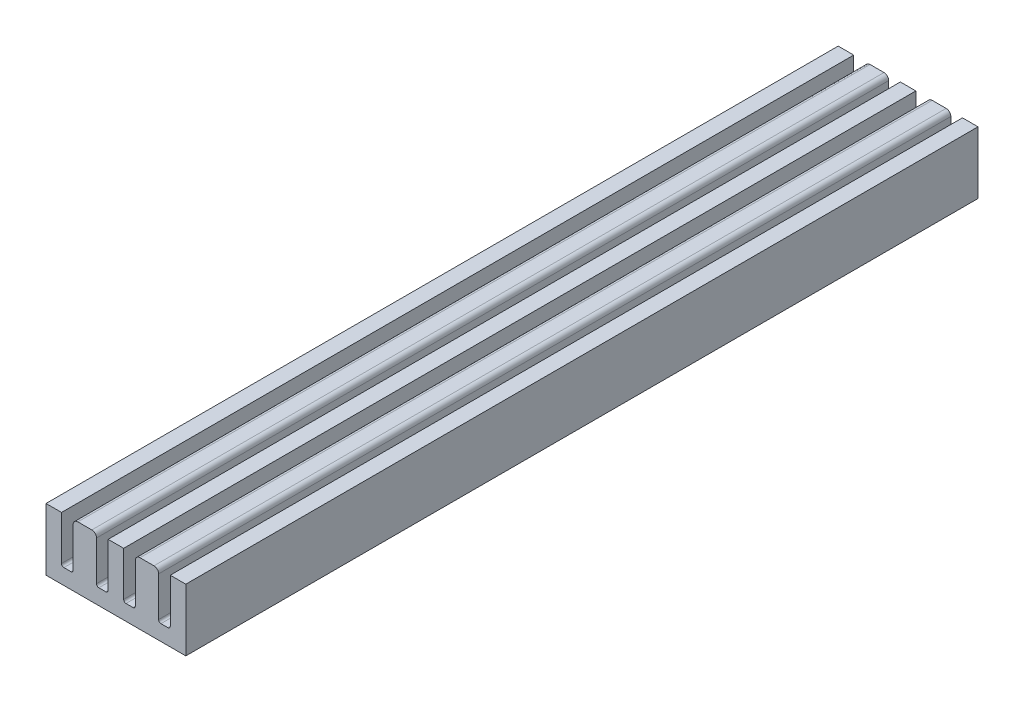
ISO-10303-21;
HEADER;
FILE_DESCRIPTION(('STEP AP214'),'2;1');
FILE_NAME('part.step','',(''),(''),'','','');
FILE_SCHEMA(('AUTOMOTIVE_DESIGN { 1 0 10303 214 1 1 1 1 }'));
ENDSEC;
DATA;
#1=APPLICATION_CONTEXT('core data for automotive mechanical design processes');
#2=APPLICATION_PROTOCOL_DEFINITION('international standard','automotive_design',2000,#1);
#3=PRODUCT_CONTEXT('',#1,'mechanical');
#4=PRODUCT('Part','Part','',(#3));
#5=PRODUCT_RELATED_PRODUCT_CATEGORY('part','',(#4));
#6=PRODUCT_DEFINITION_FORMATION('','',#4);
#7=PRODUCT_DEFINITION_CONTEXT('part definition',#1,'design');
#8=PRODUCT_DEFINITION('design','',#6,#7);
#9=PRODUCT_DEFINITION_SHAPE('','',#8);
#10=(LENGTH_UNIT() NAMED_UNIT(*) SI_UNIT(.MILLI.,.METRE.));
#11=(NAMED_UNIT(*) PLANE_ANGLE_UNIT() SI_UNIT($,.RADIAN.));
#12=(NAMED_UNIT(*) SI_UNIT($,.STERADIAN.) SOLID_ANGLE_UNIT());
#13=UNCERTAINTY_MEASURE_WITH_UNIT(LENGTH_MEASURE(1.E-05),#10,'distance_accuracy_value','');
#14=(GEOMETRIC_REPRESENTATION_CONTEXT(3) GLOBAL_UNCERTAINTY_ASSIGNED_CONTEXT((#13)) GLOBAL_UNIT_ASSIGNED_CONTEXT((#10,
#11,#12)) REPRESENTATION_CONTEXT('',''));
#15=CARTESIAN_POINT('',(0.,0.,0.));
#16=DIRECTION('',(0.,0.,1.));
#17=DIRECTION('',(1.,0.,0.));
#18=AXIS2_PLACEMENT_3D('',#15,#16,#17);
#19=CARTESIAN_POINT('',(0.,-37.8703703703704,102.));
#20=DIRECTION('',(0.,-1.,0.));
#21=DIRECTION('',(0.,0.,-1.));
#22=AXIS2_PLACEMENT_3D('',#19,#20,#21);
#23=PLANE('',#22);
#24=DIRECTION('',(0.,0.,-1.));
#25=VECTOR('',#24,1.);
#26=CARTESIAN_POINT('',(8.69813267683274,-37.8703703703704,102.));
#27=LINE('',#26,#25);
#28=CARTESIAN_POINT('',(8.69813267683274,-37.8703703703704,102.));
#29=VERTEX_POINT('',#28);
#30=CARTESIAN_POINT('',(8.69813267683274,-37.8703703703704,0.));
#31=VERTEX_POINT('',#30);
#32=EDGE_CURVE('E267',#29,#31,#27,.T.);
#33=ORIENTED_EDGE('',*,*,#32,.T.);
#34=DIRECTION('',(-1.,0.,0.));
#35=VECTOR('',#34,1.);
#36=CARTESIAN_POINT('',(0.,-37.8703703703704,0.));
#37=LINE('',#36,#35);
#38=CARTESIAN_POINT('',(7.80186732316727,-37.8703703703704,0.));
#39=VERTEX_POINT('',#38);
#40=EDGE_CURVE('E404',#31,#39,#37,.T.);
#41=ORIENTED_EDGE('',*,*,#40,.T.);
#42=DIRECTION('',(0.,0.,-1.));
#43=VECTOR('',#42,1.);
#44=CARTESIAN_POINT('',(7.80186732316727,-37.8703703703704,102.));
#45=LINE('',#44,#43);
#46=CARTESIAN_POINT('',(7.80186732316727,-37.8703703703704,102.));
#47=VERTEX_POINT('',#46);
#48=EDGE_CURVE('E321',#47,#39,#45,.T.);
#49=ORIENTED_EDGE('',*,*,#48,.F.);
#50=DIRECTION('',(-1.,0.,0.));
#51=VECTOR('',#50,1.);
#52=CARTESIAN_POINT('',(0.,-37.8703703703704,102.));
#53=LINE('',#52,#51);
#54=EDGE_CURVE('E395',#29,#47,#53,.T.);
#55=ORIENTED_EDGE('',*,*,#54,.F.);
#56=EDGE_LOOP('',(#33,#41,#49,#55));
#57=FACE_BOUND('',#56,.T.);
#58=ADVANCED_FACE('F35',(#57),#23,.F.);
#59=DIRECTION('',(0.,0.,-1.));
#60=VECTOR('',#59,1.);
#61=CARTESIAN_POINT('',(4.19813267683273,-37.8703703703704,102.));
#62=LINE('',#61,#60);
#63=CARTESIAN_POINT('',(4.19813267683273,-37.8703703703704,102.));
#64=VERTEX_POINT('',#63);
#65=CARTESIAN_POINT('',(4.19813267683273,-37.8703703703704,0.));
#66=VERTEX_POINT('',#65);
#67=EDGE_CURVE('E324',#64,#66,#62,.T.);
#68=ORIENTED_EDGE('',*,*,#67,.T.);
#69=CARTESIAN_POINT('',(3.30186732316727,-37.8703703703704,0.));
#70=VERTEX_POINT('',#69);
#71=EDGE_CURVE('E407',#66,#70,#37,.T.);
#72=ORIENTED_EDGE('',*,*,#71,.T.);
#73=DIRECTION('',(0.,0.,-1.));
#74=VECTOR('',#73,1.);
#75=CARTESIAN_POINT('',(3.30186732316727,-37.8703703703704,102.));
#76=LINE('',#75,#74);
#77=CARTESIAN_POINT('',(3.30186732316727,-37.8703703703704,102.));
#78=VERTEX_POINT('',#77);
#79=EDGE_CURVE('E364',#78,#70,#76,.T.);
#80=ORIENTED_EDGE('',*,*,#79,.F.);
#81=EDGE_CURVE('E398',#64,#78,#53,.T.);
#82=ORIENTED_EDGE('',*,*,#81,.F.);
#83=EDGE_LOOP('',(#68,#72,#80,#82));
#84=FACE_BOUND('',#83,.T.);
#85=ADVANCED_FACE('F512',(#84),#23,.F.);
#86=DIRECTION('',(0.,0.,-1.));
#87=VECTOR('',#86,1.);
#88=CARTESIAN_POINT('',(0.698132676832736,-37.8703703703704,102.));
#89=LINE('',#88,#87);
#90=CARTESIAN_POINT('',(0.698132676832736,-37.8703703703704,102.));
#91=VERTEX_POINT('',#90);
#92=CARTESIAN_POINT('',(0.698132676832736,-37.8703703703704,0.));
#93=VERTEX_POINT('',#92);
#94=EDGE_CURVE('E367',#91,#93,#89,.T.);
#95=ORIENTED_EDGE('',*,*,#94,.T.);
#96=CARTESIAN_POINT('',(-0.198132676832732,-37.8703703703704,0.));
#97=VERTEX_POINT('',#96);
#98=EDGE_CURVE('E566',#93,#97,#37,.T.);
#99=ORIENTED_EDGE('',*,*,#98,.T.);
#100=DIRECTION('',(0.,0.,-1.));
#101=VECTOR('',#100,1.);
#102=CARTESIAN_POINT('',(-0.198132676832732,-37.8703703703704,102.));
#103=LINE('',#102,#101);
#104=CARTESIAN_POINT('',(-0.198132676832732,-37.8703703703704,102.));
#105=VERTEX_POINT('',#104);
#106=EDGE_CURVE('E424',#105,#97,#103,.T.);
#107=ORIENTED_EDGE('',*,*,#106,.F.);
#108=EDGE_CURVE('E539',#91,#105,#53,.T.);
#109=ORIENTED_EDGE('',*,*,#108,.F.);
#110=EDGE_LOOP('',(#95,#99,#107,#109));
#111=FACE_BOUND('',#110,.T.);
#112=ADVANCED_FACE('F519',(#111),#23,.F.);
#113=DIRECTION('',(0.,0.,-1.));
#114=VECTOR('',#113,1.);
#115=CARTESIAN_POINT('',(-4.69813267683273,-37.8703703703704,102.));
#116=LINE('',#115,#114);
#117=CARTESIAN_POINT('',(-4.69813267683273,-37.8703703703704,102.));
#118=VERTEX_POINT('',#117);
#119=CARTESIAN_POINT('',(-4.69813267683273,-37.8703703703704,0.));
#120=VERTEX_POINT('',#119);
#121=EDGE_CURVE('E393',#118,#120,#116,.T.);
#122=ORIENTED_EDGE('',*,*,#121,.F.);
#123=CARTESIAN_POINT('',(-3.80186732316727,-37.8703703703704,102.));
#124=VERTEX_POINT('',#123);
#125=EDGE_CURVE('E256',#124,#118,#53,.T.);
#126=ORIENTED_EDGE('',*,*,#125,.F.);
#127=DIRECTION('',(0.,0.,-1.));
#128=VECTOR('',#127,1.);
#129=CARTESIAN_POINT('',(-3.80186732316727,-37.8703703703704,102.));
#130=LINE('',#129,#128);
#131=CARTESIAN_POINT('',(-3.80186732316727,-37.8703703703704,0.));
#132=VERTEX_POINT('',#131);
#133=EDGE_CURVE('E436',#124,#132,#130,.T.);
#134=ORIENTED_EDGE('',*,*,#133,.T.);
#135=EDGE_CURVE('E403',#132,#120,#37,.T.);
#136=ORIENTED_EDGE('',*,*,#135,.T.);
#137=EDGE_LOOP('',(#122,#126,#134,#136));
#138=FACE_BOUND('',#137,.T.);
#139=ADVANCED_FACE('F515',(#138),#23,.F.);
#140=CARTESIAN_POINT('',(-0.499999999999999,0.,102.));
#141=DIRECTION('',(1.,0.,0.));
#142=DIRECTION('',(0.,0.,-1.));
#143=AXIS2_PLACEMENT_3D('',#140,#141,#142);
#144=PLANE('',#143);
#145=DIRECTION('',(0.,-1.,0.));
#146=VECTOR('',#145,1.);
#147=CARTESIAN_POINT('',(-0.499999999999999,0.,0.));
#148=LINE('',#147,#146);
#149=CARTESIAN_POINT('',(-0.499999999999999,-32.4703703703704,0.));
#150=VERTEX_POINT('',#149);
#151=CARTESIAN_POINT('',(-0.499999999999999,-37.5685030472031,0.));
#152=VERTEX_POINT('',#151);
#153=EDGE_CURVE('E443',#150,#152,#148,.T.);
#154=ORIENTED_EDGE('',*,*,#153,.F.);
#155=DIRECTION('',(0.,0.,-1.));
#156=VECTOR('',#155,1.);
#157=CARTESIAN_POINT('',(-0.499999999999999,-32.4703703703704,102.));
#158=LINE('',#157,#156);
#159=CARTESIAN_POINT('',(-0.499999999999999,-32.4703703703704,102.));
#160=VERTEX_POINT('',#159);
#161=EDGE_CURVE('E43',#150,#160,#158,.F.);
#162=ORIENTED_EDGE('',*,*,#161,.T.);
#163=DIRECTION('',(0.,-1.,0.));
#164=VECTOR('',#163,1.);
#165=CARTESIAN_POINT('',(-0.499999999999999,0.,102.));
#166=LINE('',#165,#164);
#167=CARTESIAN_POINT('',(-0.499999999999999,-37.5685030472031,102.));
#168=VERTEX_POINT('',#167);
#169=EDGE_CURVE('E445',#160,#168,#166,.T.);
#170=ORIENTED_EDGE('',*,*,#169,.T.);
#171=DIRECTION('',(0.,0.,-1.));
#172=VECTOR('',#171,1.);
#173=CARTESIAN_POINT('',(-0.499999999999999,-37.5685030472031,102.));
#174=LINE('',#173,#172);
#175=EDGE_CURVE('E419',#168,#152,#174,.T.);
#176=ORIENTED_EDGE('',*,*,#175,.T.);
#177=EDGE_LOOP('',(#154,#162,#170,#176));
#178=FACE_BOUND('',#177,.T.);
#179=ADVANCED_FACE('F524',(#178),#144,.T.);
#180=CARTESIAN_POINT('',(0.,-31.8703703703704,102.));
#181=DIRECTION('',(0.,-1.,0.));
#182=DIRECTION('',(0.,0.,-1.));
#183=AXIS2_PLACEMENT_3D('',#180,#181,#182);
#184=PLANE('',#183);
#185=DIRECTION('',(-1.,0.,0.));
#186=VECTOR('',#185,1.);
#187=CARTESIAN_POINT('',(0.,-31.8703703703704,102.));
#188=LINE('',#187,#186);
#189=CARTESIAN_POINT('',(-1.1,-31.8703703703704,102.));
#190=VERTEX_POINT('',#189);
#191=CARTESIAN_POINT('',(-2.9,-31.8703703703704,102.));
#192=VERTEX_POINT('',#191);
#193=EDGE_CURVE('E439',#190,#192,#188,.T.);
#194=ORIENTED_EDGE('',*,*,#193,.F.);
#195=DIRECTION('',(0.,0.,-1.));
#196=VECTOR('',#195,1.);
#197=CARTESIAN_POINT('',(-1.1,-31.8703703703704,0.));
#198=LINE('',#197,#196);
#199=CARTESIAN_POINT('',(-1.1,-31.8703703703704,0.));
#200=VERTEX_POINT('',#199);
#201=EDGE_CURVE('E479',#190,#200,#198,.T.);
#202=ORIENTED_EDGE('',*,*,#201,.T.);
#203=DIRECTION('',(-1.,0.,0.));
#204=VECTOR('',#203,1.);
#205=CARTESIAN_POINT('',(0.,-31.8703703703704,0.));
#206=LINE('',#205,#204);
#207=CARTESIAN_POINT('',(-2.9,-31.8703703703704,0.));
#208=VERTEX_POINT('',#207);
#209=EDGE_CURVE('E438',#200,#208,#206,.T.);
#210=ORIENTED_EDGE('',*,*,#209,.T.);
#211=DIRECTION('',(0.,0.,-1.));
#212=VECTOR('',#211,1.);
#213=CARTESIAN_POINT('',(-2.9,-31.8703703703704,102.));
#214=LINE('',#213,#212);
#215=EDGE_CURVE('E477',#208,#192,#214,.F.);
#216=ORIENTED_EDGE('',*,*,#215,.T.);
#217=EDGE_LOOP('',(#194,#202,#210,#216));
#218=FACE_BOUND('',#217,.T.);
#219=ADVANCED_FACE('F485',(#218),#184,.F.);
#220=CARTESIAN_POINT('',(-3.50000000000001,0.,102.));
#221=DIRECTION('',(1.,0.,0.));
#222=DIRECTION('',(0.,1.,0.));
#223=AXIS2_PLACEMENT_3D('',#220,#221,#222);
#224=PLANE('',#223);
#225=DIRECTION('',(0.,-1.,0.));
#226=VECTOR('',#225,1.);
#227=CARTESIAN_POINT('',(-3.50000000000001,0.,102.));
#228=LINE('',#227,#226);
#229=CARTESIAN_POINT('',(-3.5,-32.4703703703704,102.));
#230=VERTEX_POINT('',#229);
#231=CARTESIAN_POINT('',(-3.5,-37.5685030472031,102.));
#232=VERTEX_POINT('',#231);
#233=EDGE_CURVE('E442',#230,#232,#228,.T.);
#234=ORIENTED_EDGE('',*,*,#233,.F.);
#235=DIRECTION('',(0.,0.,-1.));
#236=VECTOR('',#235,1.);
#237=CARTESIAN_POINT('',(-3.5,-32.4703703703704,102.));
#238=LINE('',#237,#236);
#239=CARTESIAN_POINT('',(-3.5,-32.4703703703704,0.));
#240=VERTEX_POINT('',#239);
#241=EDGE_CURVE('E11',#230,#240,#238,.T.);
#242=ORIENTED_EDGE('',*,*,#241,.T.);
#243=DIRECTION('',(0.,-1.,0.));
#244=VECTOR('',#243,1.);
#245=CARTESIAN_POINT('',(-3.50000000000001,0.,0.));
#246=LINE('',#245,#244);
#247=CARTESIAN_POINT('',(-3.5,-37.5685030472031,0.));
#248=VERTEX_POINT('',#247);
#249=EDGE_CURVE('E450',#240,#248,#246,.T.);
#250=ORIENTED_EDGE('',*,*,#249,.T.);
#251=DIRECTION('',(0.,0.,-1.));
#252=VECTOR('',#251,1.);
#253=CARTESIAN_POINT('',(-3.5,-37.5685030472031,102.));
#254=LINE('',#253,#252);
#255=EDGE_CURVE('E431',#232,#248,#254,.T.);
#256=ORIENTED_EDGE('',*,*,#255,.F.);
#257=EDGE_LOOP('',(#234,#242,#250,#256));
#258=FACE_BOUND('',#257,.T.);
#259=ADVANCED_FACE('F497',(#258),#224,.F.);
#260=CARTESIAN_POINT('',(0.,0.,102.));
#261=DIRECTION('',(0.,0.,1.));
#262=DIRECTION('',(1.,0.,0.));
#263=AXIS2_PLACEMENT_3D('',#260,#261,#262);
#264=PLANE('',#263);
#265=DIRECTION('',(0.,1.,0.));
#266=VECTOR('',#265,1.);
#267=CARTESIAN_POINT('',(7.50000000000022,0.,102.));
#268=LINE('',#267,#266);
#269=CARTESIAN_POINT('',(7.5,-37.5685030472031,102.));
#270=VERTEX_POINT('',#269);
#271=CARTESIAN_POINT('',(7.50000000000003,-32.4703703703704,102.));
#272=VERTEX_POINT('',#271);
#273=EDGE_CURVE('E297',#270,#272,#268,.T.);
#274=ORIENTED_EDGE('',*,*,#273,.T.);
#275=CARTESIAN_POINT('',(6.90000000000003,-32.4703703703704,102.));
#276=DIRECTION('',(0.,0.,1.));
#277=DIRECTION('',(1.,0.,0.));
#278=AXIS2_PLACEMENT_3D('',#275,#276,#277);
#279=CIRCLE('',#278,0.6);
#280=CARTESIAN_POINT('',(6.90000000000003,-31.8703703703704,102.));
#281=VERTEX_POINT('',#280);
#282=EDGE_CURVE('E472',#272,#281,#279,.T.);
#283=ORIENTED_EDGE('',*,*,#282,.T.);
#284=DIRECTION('',(1.,0.,0.));
#285=VECTOR('',#284,1.);
#286=CARTESIAN_POINT('',(0.,-31.8703703703704,102.));
#287=LINE('',#286,#285);
#288=CARTESIAN_POINT('',(5.1,-31.8703703703704,102.));
#289=VERTEX_POINT('',#288);
#290=EDGE_CURVE('E299',#289,#281,#287,.T.);
#291=ORIENTED_EDGE('',*,*,#290,.F.);
#292=CARTESIAN_POINT('',(5.1,-32.4703703703704,102.));
#293=DIRECTION('',(0.,0.,1.));
#294=DIRECTION('',(1.,0.,0.));
#295=AXIS2_PLACEMENT_3D('',#292,#293,#294);
#296=CIRCLE('',#295,0.6);
#297=CARTESIAN_POINT('',(4.5,-32.4703703703704,102.));
#298=VERTEX_POINT('',#297);
#299=EDGE_CURVE('E57',#289,#298,#296,.T.);
#300=ORIENTED_EDGE('',*,*,#299,.T.);
#301=DIRECTION('',(0.,-1.,0.));
#302=VECTOR('',#301,1.);
#303=CARTESIAN_POINT('',(4.5,0.,102.));
#304=LINE('',#303,#302);
#305=CARTESIAN_POINT('',(4.5,-37.5685030472031,102.));
#306=VERTEX_POINT('',#305);
#307=EDGE_CURVE('E302',#298,#306,#304,.T.);
#308=ORIENTED_EDGE('',*,*,#307,.T.);
#309=CARTESIAN_POINT('',(4.19813267683273,-37.5685030472031,102.));
#310=DIRECTION('',(0.,0.,1.));
#311=DIRECTION('',(1.,0.,0.));
#312=AXIS2_PLACEMENT_3D('',#309,#310,#311);
#313=CIRCLE('',#312,0.301867323167268);
#314=EDGE_CURVE('E291',#64,#306,#313,.T.);
#315=ORIENTED_EDGE('',*,*,#314,.F.);
#316=ORIENTED_EDGE('',*,*,#81,.T.);
#317=CARTESIAN_POINT('',(3.30186732316727,-37.5685030472031,102.));
#318=DIRECTION('',(0.,0.,1.));
#319=DIRECTION('',(1.,0.,0.));
#320=AXIS2_PLACEMENT_3D('',#317,#318,#319);
#321=CIRCLE('',#320,0.301867323167267);
#322=CARTESIAN_POINT('',(3.,-37.5685030472031,102.));
#323=VERTEX_POINT('',#322);
#324=EDGE_CURVE('E331',#78,#323,#321,.F.);
#325=ORIENTED_EDGE('',*,*,#324,.T.);
#326=DIRECTION('',(0.,-1.,0.));
#327=VECTOR('',#326,1.);
#328=CARTESIAN_POINT('',(2.99999999999999,0.,102.));
#329=LINE('',#328,#327);
#330=CARTESIAN_POINT('',(3.,-31.8703703703704,102.));
#331=VERTEX_POINT('',#330);
#332=EDGE_CURVE('E334',#331,#323,#329,.T.);
#333=ORIENTED_EDGE('',*,*,#332,.F.);
#334=DIRECTION('',(1.,0.,0.));
#335=VECTOR('',#334,1.);
#336=CARTESIAN_POINT('',(0.,-31.8703703703704,102.));
#337=LINE('',#336,#335);
#338=CARTESIAN_POINT('',(1.,-31.8703703703704,102.));
#339=VERTEX_POINT('',#338);
#340=EDGE_CURVE('E337',#339,#331,#337,.T.);
#341=ORIENTED_EDGE('',*,*,#340,.F.);
#342=DIRECTION('',(0.,1.,0.));
#343=VECTOR('',#342,1.);
#344=CARTESIAN_POINT('',(0.999999999999991,0.,102.));
#345=LINE('',#344,#343);
#346=CARTESIAN_POINT('',(1.,-37.5685030472031,102.));
#347=VERTEX_POINT('',#346);
#348=EDGE_CURVE('E340',#347,#339,#345,.T.);
#349=ORIENTED_EDGE('',*,*,#348,.F.);
#350=CARTESIAN_POINT('',(0.698132676832736,-37.5685030472031,102.));
#351=DIRECTION('',(0.,0.,1.));
#352=DIRECTION('',(1.,0.,0.));
#353=AXIS2_PLACEMENT_3D('',#350,#351,#352);
#354=CIRCLE('',#353,0.301867323167267);
#355=EDGE_CURVE('E328',#91,#347,#354,.T.);
#356=ORIENTED_EDGE('',*,*,#355,.F.);
#357=ORIENTED_EDGE('',*,*,#108,.T.);
#358=CARTESIAN_POINT('',(-0.198132676832732,-37.5685030472031,102.));
#359=DIRECTION('',(0.,0.,1.));
#360=DIRECTION('',(1.,0.,0.));
#361=AXIS2_PLACEMENT_3D('',#358,#359,#360);
#362=CIRCLE('',#361,0.301867323167268);
#363=EDGE_CURVE('E416',#105,#168,#362,.F.);
#364=ORIENTED_EDGE('',*,*,#363,.T.);
#365=ORIENTED_EDGE('',*,*,#169,.F.);
#366=CARTESIAN_POINT('',(-1.1,-32.4703703703704,102.));
#367=DIRECTION('',(0.,0.,1.));
#368=DIRECTION('',(1.,0.,0.));
#369=AXIS2_PLACEMENT_3D('',#366,#367,#368);
#370=CIRCLE('',#369,0.6);
#371=EDGE_CURVE('E469',#160,#190,#370,.T.);
#372=ORIENTED_EDGE('',*,*,#371,.T.);
#373=ORIENTED_EDGE('',*,*,#193,.T.);
#374=CARTESIAN_POINT('',(-2.9,-32.4703703703704,102.));
#375=DIRECTION('',(0.,0.,1.));
#376=DIRECTION('',(1.,0.,0.));
#377=AXIS2_PLACEMENT_3D('',#374,#375,#376);
#378=CIRCLE('',#377,0.6);
#379=EDGE_CURVE('E467',#192,#230,#378,.T.);
#380=ORIENTED_EDGE('',*,*,#379,.T.);
#381=ORIENTED_EDGE('',*,*,#233,.T.);
#382=CARTESIAN_POINT('',(-3.80186732316727,-37.5685030472031,102.));
#383=DIRECTION('',(0.,0.,1.));
#384=DIRECTION('',(1.,0.,0.));
#385=AXIS2_PLACEMENT_3D('',#382,#383,#384);
#386=CIRCLE('',#385,0.301867323167268);
#387=EDGE_CURVE('E428',#124,#232,#386,.T.);
#388=ORIENTED_EDGE('',*,*,#387,.F.);
#389=ORIENTED_EDGE('',*,*,#125,.T.);
#390=CARTESIAN_POINT('',(-4.69813267683273,-37.5685030472031,102.));
#391=DIRECTION('',(0.,0.,1.));
#392=DIRECTION('',(1.,0.,0.));
#393=AXIS2_PLACEMENT_3D('',#390,#391,#392);
#394=CIRCLE('',#393,0.301867323167267);
#395=CARTESIAN_POINT('',(-5.,-37.5685030472031,102.));
#396=VERTEX_POINT('',#395);
#397=EDGE_CURVE('E371',#118,#396,#394,.F.);
#398=ORIENTED_EDGE('',*,*,#397,.T.);
#399=DIRECTION('',(0.,1.,0.));
#400=VECTOR('',#399,1.);
#401=CARTESIAN_POINT('',(-5.,0.,102.));
#402=LINE('',#401,#400);
#403=CARTESIAN_POINT('',(-5.,-31.8703703703704,102.));
#404=VERTEX_POINT('',#403);
#405=EDGE_CURVE('E373',#396,#404,#402,.T.);
#406=ORIENTED_EDGE('',*,*,#405,.T.);
#407=DIRECTION('',(-1.,0.,0.));
#408=VECTOR('',#407,1.);
#409=CARTESIAN_POINT('',(0.,-31.8703703703704,102.));
#410=LINE('',#409,#408);
#411=CARTESIAN_POINT('',(-7.,-31.8703703703704,102.));
#412=VERTEX_POINT('',#411);
#413=EDGE_CURVE('E376',#404,#412,#410,.T.);
#414=ORIENTED_EDGE('',*,*,#413,.T.);
#415=DIRECTION('',(0.,-1.,0.));
#416=VECTOR('',#415,1.);
#417=CARTESIAN_POINT('',(-7.,0.,102.));
#418=LINE('',#417,#416);
#419=CARTESIAN_POINT('',(-7.,-39.8703703703704,102.));
#420=VERTEX_POINT('',#419);
#421=EDGE_CURVE('E397',#412,#420,#418,.T.);
#422=ORIENTED_EDGE('',*,*,#421,.T.);
#423=DIRECTION('',(1.,0.,0.));
#424=VECTOR('',#423,1.);
#425=CARTESIAN_POINT('',(0.,-39.8703703703704,102.));
#426=LINE('',#425,#424);
#427=CARTESIAN_POINT('',(11.,-39.8703703703704,102.));
#428=VERTEX_POINT('',#427);
#429=EDGE_CURVE('E253',#420,#428,#426,.T.);
#430=ORIENTED_EDGE('',*,*,#429,.T.);
#431=DIRECTION('',(0.,-1.,0.));
#432=VECTOR('',#431,1.);
#433=CARTESIAN_POINT('',(11.,0.,102.));
#434=LINE('',#433,#432);
#435=CARTESIAN_POINT('',(11.,-31.8703703703704,102.));
#436=VERTEX_POINT('',#435);
#437=EDGE_CURVE('E244',#436,#428,#434,.T.);
#438=ORIENTED_EDGE('',*,*,#437,.F.);
#439=DIRECTION('',(1.,0.,0.));
#440=VECTOR('',#439,1.);
#441=CARTESIAN_POINT('',(0.,-31.8703703703704,102.));
#442=LINE('',#441,#440);
#443=CARTESIAN_POINT('',(9.,-31.8703703703704,102.));
#444=VERTEX_POINT('',#443);
#445=EDGE_CURVE('E250',#444,#436,#442,.T.);
#446=ORIENTED_EDGE('',*,*,#445,.F.);
#447=DIRECTION('',(0.,1.,0.));
#448=VECTOR('',#447,1.);
#449=CARTESIAN_POINT('',(9.,0.,102.));
#450=LINE('',#449,#448);
#451=CARTESIAN_POINT('',(9.,-37.5685030472031,102.));
#452=VERTEX_POINT('',#451);
#453=EDGE_CURVE('E271',#452,#444,#450,.T.);
#454=ORIENTED_EDGE('',*,*,#453,.F.);
#455=CARTESIAN_POINT('',(8.69813267683274,-37.5685030472031,102.));
#456=DIRECTION('',(0.,0.,1.));
#457=DIRECTION('',(1.,0.,0.));
#458=AXIS2_PLACEMENT_3D('',#455,#456,#457);
#459=CIRCLE('',#458,0.301867323167266);
#460=EDGE_CURVE('E272',#29,#452,#459,.T.);
#461=ORIENTED_EDGE('',*,*,#460,.F.);
#462=ORIENTED_EDGE('',*,*,#54,.T.);
#463=CARTESIAN_POINT('',(7.80186732316727,-37.5685030472031,102.));
#464=DIRECTION('',(0.,0.,1.));
#465=DIRECTION('',(1.,0.,0.));
#466=AXIS2_PLACEMENT_3D('',#463,#464,#465);
#467=CIRCLE('',#466,0.301867323167268);
#468=EDGE_CURVE('E294',#47,#270,#467,.F.);
#469=ORIENTED_EDGE('',*,*,#468,.T.);
#470=EDGE_LOOP('',(#274,#283,#291,#300,#308,#315,#316,#325,#333,#341,#349,#356,#357,#364,#365,
#372,#373,#380,#381,#388,#389,#398,#406,#414,#422,#430,#438,#446,#454,#461,#462,#469));
#471=FACE_BOUND('',#470,.T.);
#472=ADVANCED_FACE('F247',(#471),#264,.T.);
#473=CARTESIAN_POINT('',(0.,0.,0.));
#474=DIRECTION('',(0.,0.,1.));
#475=DIRECTION('',(1.,0.,0.));
#476=AXIS2_PLACEMENT_3D('',#473,#474,#475);
#477=PLANE('',#476);
#478=DIRECTION('',(1.,0.,0.));
#479=VECTOR('',#478,1.);
#480=CARTESIAN_POINT('',(0.,-31.8703703703704,0.));
#481=LINE('',#480,#479);
#482=CARTESIAN_POINT('',(5.1,-31.8703703703704,0.));
#483=VERTEX_POINT('',#482);
#484=CARTESIAN_POINT('',(6.90000000000003,-31.8703703703704,0.));
#485=VERTEX_POINT('',#484);
#486=EDGE_CURVE('E312',#483,#485,#481,.T.);
#487=ORIENTED_EDGE('',*,*,#486,.T.);
#488=CARTESIAN_POINT('',(6.90000000000003,-32.4703703703704,0.));
#489=DIRECTION('',(0.,0.,1.));
#490=DIRECTION('',(1.,0.,0.));
#491=AXIS2_PLACEMENT_3D('',#488,#489,#490);
#492=CIRCLE('',#491,0.6);
#493=CARTESIAN_POINT('',(7.50000000000003,-32.4703703703704,0.));
#494=VERTEX_POINT('',#493);
#495=EDGE_CURVE('E463',#485,#494,#492,.F.);
#496=ORIENTED_EDGE('',*,*,#495,.T.);
#497=DIRECTION('',(0.,1.,0.));
#498=VECTOR('',#497,1.);
#499=CARTESIAN_POINT('',(7.50000000000022,0.,0.));
#500=LINE('',#499,#498);
#501=CARTESIAN_POINT('',(7.5,-37.5685030472031,0.));
#502=VERTEX_POINT('',#501);
#503=EDGE_CURVE('E309',#502,#494,#500,.T.);
#504=ORIENTED_EDGE('',*,*,#503,.F.);
#505=CARTESIAN_POINT('',(7.80186732316727,-37.5685030472031,0.));
#506=DIRECTION('',(0.,0.,1.));
#507=DIRECTION('',(1.,0.,0.));
#508=AXIS2_PLACEMENT_3D('',#505,#506,#507);
#509=CIRCLE('',#508,0.301867323167268);
#510=EDGE_CURVE('E307',#39,#502,#509,.F.);
#511=ORIENTED_EDGE('',*,*,#510,.F.);
#512=ORIENTED_EDGE('',*,*,#40,.F.);
#513=CARTESIAN_POINT('',(8.69813267683274,-37.5685030472031,0.));
#514=DIRECTION('',(0.,0.,1.));
#515=DIRECTION('',(1.,0.,0.));
#516=AXIS2_PLACEMENT_3D('',#513,#514,#515);
#517=CIRCLE('',#516,0.301867323167266);
#518=CARTESIAN_POINT('',(9.,-37.5685030472031,0.));
#519=VERTEX_POINT('',#518);
#520=EDGE_CURVE('E280',#31,#519,#517,.T.);
#521=ORIENTED_EDGE('',*,*,#520,.T.);
#522=DIRECTION('',(0.,1.,0.));
#523=VECTOR('',#522,1.);
#524=CARTESIAN_POINT('',(9.,0.,0.));
#525=LINE('',#524,#523);
#526=CARTESIAN_POINT('',(9.,-31.8703703703704,0.));
#527=VERTEX_POINT('',#526);
#528=EDGE_CURVE('E277',#519,#527,#525,.T.);
#529=ORIENTED_EDGE('',*,*,#528,.T.);
#530=DIRECTION('',(1.,0.,0.));
#531=VECTOR('',#530,1.);
#532=CARTESIAN_POINT('',(0.,-31.8703703703704,0.));
#533=LINE('',#532,#531);
#534=CARTESIAN_POINT('',(11.,-31.8703703703704,0.));
#535=VERTEX_POINT('',#534);
#536=EDGE_CURVE('E283',#527,#535,#533,.T.);
#537=ORIENTED_EDGE('',*,*,#536,.T.);
#538=DIRECTION('',(0.,-1.,0.));
#539=VECTOR('',#538,1.);
#540=CARTESIAN_POINT('',(11.,0.,0.));
#541=LINE('',#540,#539);
#542=CARTESIAN_POINT('',(11.,-39.8703703703704,0.));
#543=VERTEX_POINT('',#542);
#544=EDGE_CURVE('E263',#535,#543,#541,.T.);
#545=ORIENTED_EDGE('',*,*,#544,.T.);
#546=DIRECTION('',(1.,0.,0.));
#547=VECTOR('',#546,1.);
#548=CARTESIAN_POINT('',(0.,-39.8703703703704,0.));
#549=LINE('',#548,#547);
#550=CARTESIAN_POINT('',(-7.,-39.8703703703704,0.));
#551=VERTEX_POINT('',#550);
#552=EDGE_CURVE('E257',#551,#543,#549,.T.);
#553=ORIENTED_EDGE('',*,*,#552,.F.);
#554=DIRECTION('',(0.,-1.,0.));
#555=VECTOR('',#554,1.);
#556=CARTESIAN_POINT('',(-7.,0.,0.));
#557=LINE('',#556,#555);
#558=CARTESIAN_POINT('',(-7.,-31.8703703703704,0.));
#559=VERTEX_POINT('',#558);
#560=EDGE_CURVE('E406',#559,#551,#557,.T.);
#561=ORIENTED_EDGE('',*,*,#560,.F.);
#562=DIRECTION('',(-1.,0.,0.));
#563=VECTOR('',#562,1.);
#564=CARTESIAN_POINT('',(0.,-31.8703703703704,0.));
#565=LINE('',#564,#563);
#566=CARTESIAN_POINT('',(-5.,-31.8703703703704,0.));
#567=VERTEX_POINT('',#566);
#568=EDGE_CURVE('E374',#567,#559,#565,.T.);
#569=ORIENTED_EDGE('',*,*,#568,.F.);
#570=DIRECTION('',(0.,1.,0.));
#571=VECTOR('',#570,1.);
#572=CARTESIAN_POINT('',(-5.,0.,0.));
#573=LINE('',#572,#571);
#574=CARTESIAN_POINT('',(-5.,-37.5685030472031,0.));
#575=VERTEX_POINT('',#574);
#576=EDGE_CURVE('E381',#575,#567,#573,.T.);
#577=ORIENTED_EDGE('',*,*,#576,.F.);
#578=CARTESIAN_POINT('',(-4.69813267683273,-37.5685030472031,0.));
#579=DIRECTION('',(0.,0.,1.));
#580=DIRECTION('',(1.,0.,0.));
#581=AXIS2_PLACEMENT_3D('',#578,#579,#580);
#582=CIRCLE('',#581,0.301867323167267);
#583=EDGE_CURVE('E370',#120,#575,#582,.F.);
#584=ORIENTED_EDGE('',*,*,#583,.F.);
#585=ORIENTED_EDGE('',*,*,#135,.F.);
#586=CARTESIAN_POINT('',(-3.80186732316727,-37.5685030472031,0.));
#587=DIRECTION('',(0.,0.,1.));
#588=DIRECTION('',(1.,0.,0.));
#589=AXIS2_PLACEMENT_3D('',#586,#587,#588);
#590=CIRCLE('',#589,0.301867323167268);
#591=EDGE_CURVE('E427',#132,#248,#590,.T.);
#592=ORIENTED_EDGE('',*,*,#591,.T.);
#593=ORIENTED_EDGE('',*,*,#249,.F.);
#594=CARTESIAN_POINT('',(-2.9,-32.4703703703704,0.));
#595=DIRECTION('',(0.,0.,1.));
#596=DIRECTION('',(1.,0.,0.));
#597=AXIS2_PLACEMENT_3D('',#594,#595,#596);
#598=CIRCLE('',#597,0.6);
#599=EDGE_CURVE('E457',#240,#208,#598,.F.);
#600=ORIENTED_EDGE('',*,*,#599,.T.);
#601=ORIENTED_EDGE('',*,*,#209,.F.);
#602=CARTESIAN_POINT('',(-1.1,-32.4703703703704,0.));
#603=DIRECTION('',(0.,0.,1.));
#604=DIRECTION('',(1.,0.,0.));
#605=AXIS2_PLACEMENT_3D('',#602,#603,#604);
#606=CIRCLE('',#605,0.6);
#607=EDGE_CURVE('E459',#200,#150,#606,.F.);
#608=ORIENTED_EDGE('',*,*,#607,.T.);
#609=ORIENTED_EDGE('',*,*,#153,.T.);
#610=CARTESIAN_POINT('',(-0.198132676832732,-37.5685030472031,0.));
#611=DIRECTION('',(0.,0.,1.));
#612=DIRECTION('',(1.,0.,0.));
#613=AXIS2_PLACEMENT_3D('',#610,#611,#612);
#614=CIRCLE('',#613,0.301867323167268);
#615=EDGE_CURVE('E415',#97,#152,#614,.F.);
#616=ORIENTED_EDGE('',*,*,#615,.F.);
#617=ORIENTED_EDGE('',*,*,#98,.F.);
#618=CARTESIAN_POINT('',(0.698132676832736,-37.5685030472031,0.));
#619=DIRECTION('',(0.,0.,1.));
#620=DIRECTION('',(1.,0.,0.));
#621=AXIS2_PLACEMENT_3D('',#618,#619,#620);
#622=CIRCLE('',#621,0.301867323167267);
#623=CARTESIAN_POINT('',(1.,-37.5685030472031,0.));
#624=VERTEX_POINT('',#623);
#625=EDGE_CURVE('E327',#93,#624,#622,.T.);
#626=ORIENTED_EDGE('',*,*,#625,.T.);
#627=DIRECTION('',(0.,1.,0.));
#628=VECTOR('',#627,1.);
#629=CARTESIAN_POINT('',(0.999999999999991,0.,0.));
#630=LINE('',#629,#628);
#631=CARTESIAN_POINT('',(1.,-31.8703703703704,0.));
#632=VERTEX_POINT('',#631);
#633=EDGE_CURVE('E332',#624,#632,#630,.T.);
#634=ORIENTED_EDGE('',*,*,#633,.T.);
#635=DIRECTION('',(1.,0.,0.));
#636=VECTOR('',#635,1.);
#637=CARTESIAN_POINT('',(0.,-31.8703703703704,0.));
#638=LINE('',#637,#636);
#639=CARTESIAN_POINT('',(3.,-31.8703703703704,0.));
#640=VERTEX_POINT('',#639);
#641=EDGE_CURVE('E352',#632,#640,#638,.T.);
#642=ORIENTED_EDGE('',*,*,#641,.T.);
#643=DIRECTION('',(0.,-1.,0.));
#644=VECTOR('',#643,1.);
#645=CARTESIAN_POINT('',(2.99999999999999,0.,0.));
#646=LINE('',#645,#644);
#647=CARTESIAN_POINT('',(3.,-37.5685030472031,0.));
#648=VERTEX_POINT('',#647);
#649=EDGE_CURVE('E349',#640,#648,#646,.T.);
#650=ORIENTED_EDGE('',*,*,#649,.T.);
#651=CARTESIAN_POINT('',(3.30186732316727,-37.5685030472031,0.));
#652=DIRECTION('',(0.,0.,1.));
#653=DIRECTION('',(1.,0.,0.));
#654=AXIS2_PLACEMENT_3D('',#651,#652,#653);
#655=CIRCLE('',#654,0.301867323167267);
#656=EDGE_CURVE('E346',#70,#648,#655,.F.);
#657=ORIENTED_EDGE('',*,*,#656,.F.);
#658=ORIENTED_EDGE('',*,*,#71,.F.);
#659=CARTESIAN_POINT('',(4.19813267683273,-37.5685030472031,0.));
#660=DIRECTION('',(0.,0.,1.));
#661=DIRECTION('',(1.,0.,0.));
#662=AXIS2_PLACEMENT_3D('',#659,#660,#661);
#663=CIRCLE('',#662,0.301867323167268);
#664=CARTESIAN_POINT('',(4.5,-37.5685030472031,0.));
#665=VERTEX_POINT('',#664);
#666=EDGE_CURVE('E290',#66,#665,#663,.T.);
#667=ORIENTED_EDGE('',*,*,#666,.T.);
#668=DIRECTION('',(0.,-1.,0.));
#669=VECTOR('',#668,1.);
#670=CARTESIAN_POINT('',(4.5,0.,0.));
#671=LINE('',#670,#669);
#672=CARTESIAN_POINT('',(4.5,-32.4703703703704,0.));
#673=VERTEX_POINT('',#672);
#674=EDGE_CURVE('E295',#673,#665,#671,.T.);
#675=ORIENTED_EDGE('',*,*,#674,.F.);
#676=CARTESIAN_POINT('',(5.1,-32.4703703703704,0.));
#677=DIRECTION('',(0.,0.,1.));
#678=DIRECTION('',(1.,0.,0.));
#679=AXIS2_PLACEMENT_3D('',#676,#677,#678);
#680=CIRCLE('',#679,0.6);
#681=EDGE_CURVE('E461',#673,#483,#680,.F.);
#682=ORIENTED_EDGE('',*,*,#681,.T.);
#683=EDGE_LOOP('',(#487,#496,#504,#511,#512,#521,#529,#537,#545,#553,#561,#569,#577,#584,#585,
#592,#593,#600,#601,#608,#609,#616,#617,#626,#634,#642,#650,#657,#658,#667,#675,#682));
#684=FACE_BOUND('',#683,.T.);
#685=ADVANCED_FACE('F490',(#684),#477,.F.);
#686=CARTESIAN_POINT('',(-3.80186732316727,-37.5685030472031,102.));
#687=DIRECTION('',(0.,0.,-1.));
#688=DIRECTION('',(-1.,0.,0.));
#689=AXIS2_PLACEMENT_3D('',#686,#687,#688);
#690=CYLINDRICAL_SURFACE('',#689,0.301867323167268);
#691=ORIENTED_EDGE('',*,*,#591,.F.);
#692=ORIENTED_EDGE('',*,*,#133,.F.);
#693=ORIENTED_EDGE('',*,*,#387,.T.);
#694=ORIENTED_EDGE('',*,*,#255,.T.);
#695=EDGE_LOOP('',(#691,#692,#693,#694));
#696=FACE_BOUND('',#695,.T.);
#697=ADVANCED_FACE('F640',(#696),#690,.F.);
#698=CARTESIAN_POINT('',(-0.198132676832732,-37.5685030472031,102.));
#699=DIRECTION('',(0.,0.,-1.));
#700=DIRECTION('',(-1.,0.,0.));
#701=AXIS2_PLACEMENT_3D('',#698,#699,#700);
#702=CYLINDRICAL_SURFACE('',#701,0.301867323167268);
#703=ORIENTED_EDGE('',*,*,#615,.T.);
#704=ORIENTED_EDGE('',*,*,#175,.F.);
#705=ORIENTED_EDGE('',*,*,#363,.F.);
#706=ORIENTED_EDGE('',*,*,#106,.T.);
#707=EDGE_LOOP('',(#703,#704,#705,#706));
#708=FACE_BOUND('',#707,.T.);
#709=ADVANCED_FACE('F571',(#708),#702,.F.);
#710=CARTESIAN_POINT('',(11.,0.,102.));
#711=DIRECTION('',(1.,0.,0.));
#712=DIRECTION('',(0.,0.,-1.));
#713=AXIS2_PLACEMENT_3D('',#710,#711,#712);
#714=PLANE('',#713);
#715=ORIENTED_EDGE('',*,*,#544,.F.);
#716=DIRECTION('',(0.,0.,-1.));
#717=VECTOR('',#716,1.);
#718=CARTESIAN_POINT('',(11.,-31.8703703703704,102.));
#719=LINE('',#718,#717);
#720=EDGE_CURVE('E260',#436,#535,#719,.T.);
#721=ORIENTED_EDGE('',*,*,#720,.F.);
#722=ORIENTED_EDGE('',*,*,#437,.T.);
#723=DIRECTION('',(0.,0.,-1.));
#724=VECTOR('',#723,1.);
#725=CARTESIAN_POINT('',(11.,-39.8703703703704,102.));
#726=LINE('',#725,#724);
#727=EDGE_CURVE('E401',#428,#543,#726,.T.);
#728=ORIENTED_EDGE('',*,*,#727,.T.);
#729=EDGE_LOOP('',(#715,#721,#722,#728));
#730=FACE_BOUND('',#729,.T.);
#731=ADVANCED_FACE('F261',(#730),#714,.T.);
#732=CARTESIAN_POINT('',(-7.,0.,102.));
#733=DIRECTION('',(1.,0.,0.));
#734=DIRECTION('',(0.,0.,-1.));
#735=AXIS2_PLACEMENT_3D('',#732,#733,#734);
#736=PLANE('',#735);
#737=ORIENTED_EDGE('',*,*,#560,.T.);
#738=DIRECTION('',(0.,0.,-1.));
#739=VECTOR('',#738,1.);
#740=CARTESIAN_POINT('',(-7.,-39.8703703703704,102.));
#741=LINE('',#740,#739);
#742=EDGE_CURVE('E412',#420,#551,#741,.T.);
#743=ORIENTED_EDGE('',*,*,#742,.F.);
#744=ORIENTED_EDGE('',*,*,#421,.F.);
#745=DIRECTION('',(0.,0.,-1.));
#746=VECTOR('',#745,1.);
#747=CARTESIAN_POINT('',(-7.,-31.8703703703704,102.));
#748=LINE('',#747,#746);
#749=EDGE_CURVE('E379',#412,#559,#748,.T.);
#750=ORIENTED_EDGE('',*,*,#749,.T.);
#751=EDGE_LOOP('',(#737,#743,#744,#750));
#752=FACE_BOUND('',#751,.T.);
#753=ADVANCED_FACE('F613',(#752),#736,.F.);
#754=CARTESIAN_POINT('',(0.,-39.8703703703704,102.));
#755=DIRECTION('',(0.,1.,0.));
#756=DIRECTION('',(0.,0.,1.));
#757=AXIS2_PLACEMENT_3D('',#754,#755,#756);
#758=PLANE('',#757);
#759=ORIENTED_EDGE('',*,*,#552,.T.);
#760=ORIENTED_EDGE('',*,*,#727,.F.);
#761=ORIENTED_EDGE('',*,*,#429,.F.);
#762=ORIENTED_EDGE('',*,*,#742,.T.);
#763=EDGE_LOOP('',(#759,#760,#761,#762));
#764=FACE_BOUND('',#763,.T.);
#765=ADVANCED_FACE('F610',(#764),#758,.F.);
#766=CARTESIAN_POINT('',(-4.69813267683273,-37.5685030472031,102.));
#767=DIRECTION('',(0.,0.,-1.));
#768=DIRECTION('',(-1.,0.,0.));
#769=AXIS2_PLACEMENT_3D('',#766,#767,#768);
#770=CYLINDRICAL_SURFACE('',#769,0.301867323167267);
#771=ORIENTED_EDGE('',*,*,#583,.T.);
#772=DIRECTION('',(0.,0.,-1.));
#773=VECTOR('',#772,1.);
#774=CARTESIAN_POINT('',(-5.,-37.5685030472031,102.));
#775=LINE('',#774,#773);
#776=EDGE_CURVE('E390',#396,#575,#775,.T.);
#777=ORIENTED_EDGE('',*,*,#776,.F.);
#778=ORIENTED_EDGE('',*,*,#397,.F.);
#779=ORIENTED_EDGE('',*,*,#121,.T.);
#780=EDGE_LOOP('',(#771,#777,#778,#779));
#781=FACE_BOUND('',#780,.T.);
#782=ADVANCED_FACE('F623',(#781),#770,.F.);
#783=CARTESIAN_POINT('',(-5.,0.,102.));
#784=DIRECTION('',(-1.,0.,0.));
#785=DIRECTION('',(0.,0.,1.));
#786=AXIS2_PLACEMENT_3D('',#783,#784,#785);
#787=PLANE('',#786);
#788=ORIENTED_EDGE('',*,*,#576,.T.);
#789=DIRECTION('',(0.,0.,-1.));
#790=VECTOR('',#789,1.);
#791=CARTESIAN_POINT('',(-5.,-31.8703703703704,102.));
#792=LINE('',#791,#790);
#793=EDGE_CURVE('E387',#404,#567,#792,.T.);
#794=ORIENTED_EDGE('',*,*,#793,.F.);
#795=ORIENTED_EDGE('',*,*,#405,.F.);
#796=ORIENTED_EDGE('',*,*,#776,.T.);
#797=EDGE_LOOP('',(#788,#794,#795,#796));
#798=FACE_BOUND('',#797,.T.);
#799=ADVANCED_FACE('F621',(#798),#787,.F.);
#800=CARTESIAN_POINT('',(0.,-31.8703703703704,102.));
#801=DIRECTION('',(0.,-1.,0.));
#802=DIRECTION('',(0.,0.,-1.));
#803=AXIS2_PLACEMENT_3D('',#800,#801,#802);
#804=PLANE('',#803);
#805=ORIENTED_EDGE('',*,*,#568,.T.);
#806=ORIENTED_EDGE('',*,*,#749,.F.);
#807=ORIENTED_EDGE('',*,*,#413,.F.);
#808=ORIENTED_EDGE('',*,*,#793,.T.);
#809=EDGE_LOOP('',(#805,#806,#807,#808));
#810=FACE_BOUND('',#809,.T.);
#811=ADVANCED_FACE('F617',(#810),#804,.F.);
#812=CARTESIAN_POINT('',(0.698132676832736,-37.5685030472031,102.));
#813=DIRECTION('',(0.,0.,-1.));
#814=DIRECTION('',(-1.,0.,0.));
#815=AXIS2_PLACEMENT_3D('',#812,#813,#814);
#816=CYLINDRICAL_SURFACE('',#815,0.301867323167267);
#817=ORIENTED_EDGE('',*,*,#625,.F.);
#818=ORIENTED_EDGE('',*,*,#94,.F.);
#819=ORIENTED_EDGE('',*,*,#355,.T.);
#820=DIRECTION('',(0.,0.,-1.));
#821=VECTOR('',#820,1.);
#822=CARTESIAN_POINT('',(1.,-37.5685030472031,102.));
#823=LINE('',#822,#821);
#824=EDGE_CURVE('E343',#347,#624,#823,.T.);
#825=ORIENTED_EDGE('',*,*,#824,.T.);
#826=EDGE_LOOP('',(#817,#818,#819,#825));
#827=FACE_BOUND('',#826,.T.);
#828=ADVANCED_FACE('F565',(#827),#816,.F.);
#829=CARTESIAN_POINT('',(3.30186732316727,-37.5685030472031,102.));
#830=DIRECTION('',(0.,0.,-1.));
#831=DIRECTION('',(-1.,0.,0.));
#832=AXIS2_PLACEMENT_3D('',#829,#830,#831);
#833=CYLINDRICAL_SURFACE('',#832,0.301867323167267);
#834=ORIENTED_EDGE('',*,*,#656,.T.);
#835=DIRECTION('',(0.,0.,-1.));
#836=VECTOR('',#835,1.);
#837=CARTESIAN_POINT('',(3.,-37.5685030472031,102.));
#838=LINE('',#837,#836);
#839=EDGE_CURVE('E362',#323,#648,#838,.T.);
#840=ORIENTED_EDGE('',*,*,#839,.F.);
#841=ORIENTED_EDGE('',*,*,#324,.F.);
#842=ORIENTED_EDGE('',*,*,#79,.T.);
#843=EDGE_LOOP('',(#834,#840,#841,#842));
#844=FACE_BOUND('',#843,.T.);
#845=ADVANCED_FACE('F550',(#844),#833,.F.);
#846=CARTESIAN_POINT('',(2.99999999999999,0.,102.));
#847=DIRECTION('',(1.,0.,0.));
#848=DIRECTION('',(0.,1.,0.));
#849=AXIS2_PLACEMENT_3D('',#846,#847,#848);
#850=PLANE('',#849);
#851=ORIENTED_EDGE('',*,*,#649,.F.);
#852=DIRECTION('',(0.,0.,-1.));
#853=VECTOR('',#852,1.);
#854=CARTESIAN_POINT('',(3.,-31.8703703703704,102.));
#855=LINE('',#854,#853);
#856=EDGE_CURVE('E360',#331,#640,#855,.T.);
#857=ORIENTED_EDGE('',*,*,#856,.F.);
#858=ORIENTED_EDGE('',*,*,#332,.T.);
#859=ORIENTED_EDGE('',*,*,#839,.T.);
#860=EDGE_LOOP('',(#851,#857,#858,#859));
#861=FACE_BOUND('',#860,.T.);
#862=ADVANCED_FACE('F553',(#861),#850,.T.);
#863=CARTESIAN_POINT('',(0.,-31.8703703703704,102.));
#864=DIRECTION('',(0.,1.,0.));
#865=DIRECTION('',(0.,0.,1.));
#866=AXIS2_PLACEMENT_3D('',#863,#864,#865);
#867=PLANE('',#866);
#868=ORIENTED_EDGE('',*,*,#641,.F.);
#869=DIRECTION('',(0.,0.,-1.));
#870=VECTOR('',#869,1.);
#871=CARTESIAN_POINT('',(1.,-31.8703703703704,102.));
#872=LINE('',#871,#870);
#873=EDGE_CURVE('E358',#339,#632,#872,.T.);
#874=ORIENTED_EDGE('',*,*,#873,.F.);
#875=ORIENTED_EDGE('',*,*,#340,.T.);
#876=ORIENTED_EDGE('',*,*,#856,.T.);
#877=EDGE_LOOP('',(#868,#874,#875,#876));
#878=FACE_BOUND('',#877,.T.);
#879=ADVANCED_FACE('F558',(#878),#867,.T.);
#880=CARTESIAN_POINT('',(0.999999999999991,0.,102.));
#881=DIRECTION('',(-1.,0.,0.));
#882=DIRECTION('',(0.,-1.,0.));
#883=AXIS2_PLACEMENT_3D('',#880,#881,#882);
#884=PLANE('',#883);
#885=ORIENTED_EDGE('',*,*,#633,.F.);
#886=ORIENTED_EDGE('',*,*,#824,.F.);
#887=ORIENTED_EDGE('',*,*,#348,.T.);
#888=ORIENTED_EDGE('',*,*,#873,.T.);
#889=EDGE_LOOP('',(#885,#886,#887,#888));
#890=FACE_BOUND('',#889,.T.);
#891=ADVANCED_FACE('F561',(#890),#884,.T.);
#892=CARTESIAN_POINT('',(4.19813267683273,-37.5685030472031,102.));
#893=DIRECTION('',(0.,0.,-1.));
#894=DIRECTION('',(-1.,0.,0.));
#895=AXIS2_PLACEMENT_3D('',#892,#893,#894);
#896=CYLINDRICAL_SURFACE('',#895,0.301867323167268);
#897=ORIENTED_EDGE('',*,*,#666,.F.);
#898=ORIENTED_EDGE('',*,*,#67,.F.);
#899=ORIENTED_EDGE('',*,*,#314,.T.);
#900=DIRECTION('',(0.,0.,-1.));
#901=VECTOR('',#900,1.);
#902=CARTESIAN_POINT('',(4.5,-37.5685030472031,102.));
#903=LINE('',#902,#901);
#904=EDGE_CURVE('E304',#306,#665,#903,.T.);
#905=ORIENTED_EDGE('',*,*,#904,.T.);
#906=EDGE_LOOP('',(#897,#898,#899,#905));
#907=FACE_BOUND('',#906,.T.);
#908=ADVANCED_FACE('F575',(#907),#896,.F.);
#909=CARTESIAN_POINT('',(7.80186732316727,-37.5685030472031,102.));
#910=DIRECTION('',(0.,0.,-1.));
#911=DIRECTION('',(-1.,0.,0.));
#912=AXIS2_PLACEMENT_3D('',#909,#910,#911);
#913=CYLINDRICAL_SURFACE('',#912,0.301867323167268);
#914=ORIENTED_EDGE('',*,*,#510,.T.);
#915=DIRECTION('',(0.,0.,-1.));
#916=VECTOR('',#915,1.);
#917=CARTESIAN_POINT('',(7.5,-37.5685030472031,102.));
#918=LINE('',#917,#916);
#919=EDGE_CURVE('E318',#270,#502,#918,.T.);
#920=ORIENTED_EDGE('',*,*,#919,.F.);
#921=ORIENTED_EDGE('',*,*,#468,.F.);
#922=ORIENTED_EDGE('',*,*,#48,.T.);
#923=EDGE_LOOP('',(#914,#920,#921,#922));
#924=FACE_BOUND('',#923,.T.);
#925=ADVANCED_FACE('F596',(#924),#913,.F.);
#926=CARTESIAN_POINT('',(7.50000000000022,0.,102.));
#927=DIRECTION('',(-1.,0.,0.));
#928=DIRECTION('',(0.,-1.,0.));
#929=AXIS2_PLACEMENT_3D('',#926,#927,#928);
#930=PLANE('',#929);
#931=ORIENTED_EDGE('',*,*,#503,.T.);
#932=DIRECTION('',(0.,0.,-1.));
#933=VECTOR('',#932,1.);
#934=CARTESIAN_POINT('',(7.50000000000003,-32.4703703703704,102.));
#935=LINE('',#934,#933);
#936=EDGE_CURVE('E465',#494,#272,#935,.F.);
#937=ORIENTED_EDGE('',*,*,#936,.T.);
#938=ORIENTED_EDGE('',*,*,#273,.F.);
#939=ORIENTED_EDGE('',*,*,#919,.T.);
#940=EDGE_LOOP('',(#931,#937,#938,#939));
#941=FACE_BOUND('',#940,.T.);
#942=ADVANCED_FACE('F591',(#941),#930,.F.);
#943=CARTESIAN_POINT('',(0.,-31.8703703703704,102.));
#944=DIRECTION('',(0.,1.,0.));
#945=DIRECTION('',(0.,0.,1.));
#946=AXIS2_PLACEMENT_3D('',#943,#944,#945);
#947=PLANE('',#946);
#948=ORIENTED_EDGE('',*,*,#290,.T.);
#949=DIRECTION('',(0.,0.,-1.));
#950=VECTOR('',#949,1.);
#951=CARTESIAN_POINT('',(6.90000000000003,-31.8703703703704,0.));
#952=LINE('',#951,#950);
#953=EDGE_CURVE('E454',#281,#485,#952,.T.);
#954=ORIENTED_EDGE('',*,*,#953,.T.);
#955=ORIENTED_EDGE('',*,*,#486,.F.);
#956=DIRECTION('',(0.,0.,-1.));
#957=VECTOR('',#956,1.);
#958=CARTESIAN_POINT('',(5.1,-31.8703703703704,102.));
#959=LINE('',#958,#957);
#960=EDGE_CURVE('E447',#483,#289,#959,.F.);
#961=ORIENTED_EDGE('',*,*,#960,.T.);
#962=EDGE_LOOP('',(#948,#954,#955,#961));
#963=FACE_BOUND('',#962,.T.);
#964=ADVANCED_FACE('F583',(#963),#947,.T.);
#965=CARTESIAN_POINT('',(4.5,0.,102.));
#966=DIRECTION('',(1.,0.,0.));
#967=DIRECTION('',(0.,0.,-1.));
#968=AXIS2_PLACEMENT_3D('',#965,#966,#967);
#969=PLANE('',#968);
#970=ORIENTED_EDGE('',*,*,#307,.F.);
#971=DIRECTION('',(0.,0.,-1.));
#972=VECTOR('',#971,1.);
#973=CARTESIAN_POINT('',(4.5,-32.4703703703704,0.));
#974=LINE('',#973,#972);
#975=EDGE_CURVE('E474',#298,#673,#974,.T.);
#976=ORIENTED_EDGE('',*,*,#975,.T.);
#977=ORIENTED_EDGE('',*,*,#674,.T.);
#978=ORIENTED_EDGE('',*,*,#904,.F.);
#979=EDGE_LOOP('',(#970,#976,#977,#978));
#980=FACE_BOUND('',#979,.T.);
#981=ADVANCED_FACE('F578',(#980),#969,.F.);
#982=CARTESIAN_POINT('',(8.69813267683274,-37.5685030472031,102.));
#983=DIRECTION('',(0.,0.,-1.));
#984=DIRECTION('',(-1.,0.,0.));
#985=AXIS2_PLACEMENT_3D('',#982,#983,#984);
#986=CYLINDRICAL_SURFACE('',#985,0.301867323167266);
#987=ORIENTED_EDGE('',*,*,#520,.F.);
#988=ORIENTED_EDGE('',*,*,#32,.F.);
#989=ORIENTED_EDGE('',*,*,#460,.T.);
#990=DIRECTION('',(0.,0.,-1.));
#991=VECTOR('',#990,1.);
#992=CARTESIAN_POINT('',(9.,-37.5685030472031,102.));
#993=LINE('',#992,#991);
#994=EDGE_CURVE('E274',#452,#519,#993,.T.);
#995=ORIENTED_EDGE('',*,*,#994,.T.);
#996=EDGE_LOOP('',(#987,#988,#989,#995));
#997=FACE_BOUND('',#996,.T.);
#998=ADVANCED_FACE('F603',(#997),#986,.F.);
#999=CARTESIAN_POINT('',(0.,-31.8703703703704,102.));
#1000=DIRECTION('',(0.,1.,0.));
#1001=DIRECTION('',(0.,0.,1.));
#1002=AXIS2_PLACEMENT_3D('',#999,#1000,#1001);
#1003=PLANE('',#1002);
#1004=ORIENTED_EDGE('',*,*,#536,.F.);
#1005=DIRECTION('',(0.,0.,-1.));
#1006=VECTOR('',#1005,1.);
#1007=CARTESIAN_POINT('',(9.,-31.8703703703704,102.));
#1008=LINE('',#1007,#1006);
#1009=EDGE_CURVE('E268',#444,#527,#1008,.T.);
#1010=ORIENTED_EDGE('',*,*,#1009,.F.);
#1011=ORIENTED_EDGE('',*,*,#445,.T.);
#1012=ORIENTED_EDGE('',*,*,#720,.T.);
#1013=EDGE_LOOP('',(#1004,#1010,#1011,#1012));
#1014=FACE_BOUND('',#1013,.T.);
#1015=ADVANCED_FACE('F270',(#1014),#1003,.T.);
#1016=CARTESIAN_POINT('',(9.,0.,102.));
#1017=DIRECTION('',(-1.,0.,0.));
#1018=DIRECTION('',(0.,0.,1.));
#1019=AXIS2_PLACEMENT_3D('',#1016,#1017,#1018);
#1020=PLANE('',#1019);
#1021=ORIENTED_EDGE('',*,*,#528,.F.);
#1022=ORIENTED_EDGE('',*,*,#994,.F.);
#1023=ORIENTED_EDGE('',*,*,#453,.T.);
#1024=ORIENTED_EDGE('',*,*,#1009,.T.);
#1025=EDGE_LOOP('',(#1021,#1022,#1023,#1024));
#1026=FACE_BOUND('',#1025,.T.);
#1027=ADVANCED_FACE('F606',(#1026),#1020,.T.);
#1028=CARTESIAN_POINT('',(6.90000000000003,-32.4703703703704,102.));
#1029=DIRECTION('',(0.,0.,1.));
#1030=DIRECTION('',(1.,0.,0.));
#1031=AXIS2_PLACEMENT_3D('',#1028,#1029,#1030);
#1032=CYLINDRICAL_SURFACE('',#1031,0.6);
#1033=ORIENTED_EDGE('',*,*,#282,.F.);
#1034=ORIENTED_EDGE('',*,*,#936,.F.);
#1035=ORIENTED_EDGE('',*,*,#495,.F.);
#1036=ORIENTED_EDGE('',*,*,#953,.F.);
#1037=EDGE_LOOP('',(#1033,#1034,#1035,#1036));
#1038=FACE_BOUND('',#1037,.T.);
#1039=ADVANCED_FACE('F508',(#1038),#1032,.T.);
#1040=CARTESIAN_POINT('',(5.1,-32.4703703703704,102.));
#1041=DIRECTION('',(0.,0.,1.));
#1042=DIRECTION('',(1.,0.,0.));
#1043=AXIS2_PLACEMENT_3D('',#1040,#1041,#1042);
#1044=CYLINDRICAL_SURFACE('',#1043,0.6);
#1045=ORIENTED_EDGE('',*,*,#299,.F.);
#1046=ORIENTED_EDGE('',*,*,#960,.F.);
#1047=ORIENTED_EDGE('',*,*,#681,.F.);
#1048=ORIENTED_EDGE('',*,*,#975,.F.);
#1049=EDGE_LOOP('',(#1045,#1046,#1047,#1048));
#1050=FACE_BOUND('',#1049,.T.);
#1051=ADVANCED_FACE('F503',(#1050),#1044,.T.);
#1052=CARTESIAN_POINT('',(-1.1,-32.4703703703704,102.));
#1053=DIRECTION('',(0.,0.,1.));
#1054=DIRECTION('',(1.,0.,0.));
#1055=AXIS2_PLACEMENT_3D('',#1052,#1053,#1054);
#1056=CYLINDRICAL_SURFACE('',#1055,0.6);
#1057=ORIENTED_EDGE('',*,*,#371,.F.);
#1058=ORIENTED_EDGE('',*,*,#161,.F.);
#1059=ORIENTED_EDGE('',*,*,#607,.F.);
#1060=ORIENTED_EDGE('',*,*,#201,.F.);
#1061=EDGE_LOOP('',(#1057,#1058,#1059,#1060));
#1062=FACE_BOUND('',#1061,.T.);
#1063=ADVANCED_FACE('F501',(#1062),#1056,.T.);
#1064=CARTESIAN_POINT('',(-2.9,-32.4703703703704,102.));
#1065=DIRECTION('',(0.,0.,-1.));
#1066=DIRECTION('',(-1.,0.,0.));
#1067=AXIS2_PLACEMENT_3D('',#1064,#1065,#1066);
#1068=CYLINDRICAL_SURFACE('',#1067,0.6);
#1069=ORIENTED_EDGE('',*,*,#379,.F.);
#1070=ORIENTED_EDGE('',*,*,#215,.F.);
#1071=ORIENTED_EDGE('',*,*,#599,.F.);
#1072=ORIENTED_EDGE('',*,*,#241,.F.);
#1073=EDGE_LOOP('',(#1069,#1070,#1071,#1072));
#1074=FACE_BOUND('',#1073,.T.);
#1075=ADVANCED_FACE('F37',(#1074),#1068,.T.);
#1076=CLOSED_SHELL('',(#58,#85,#112,#139,#179,#219,#259,#472,#685,#697,#709,#731,#753,#765,#782,
#799,#811,#828,#845,#862,#879,#891,#908,#925,#942,#964,#981,#998,#1015,#1027,#1039,#1051,#1063,#1075));
#1077=MANIFOLD_SOLID_BREP('B2',#1076);
#1078=ADVANCED_BREP_SHAPE_REPRESENTATION('',(#18,#1077),#14);
#1079=SHAPE_DEFINITION_REPRESENTATION(#9,#1078);
ENDSEC;
END-ISO-10303-21;
